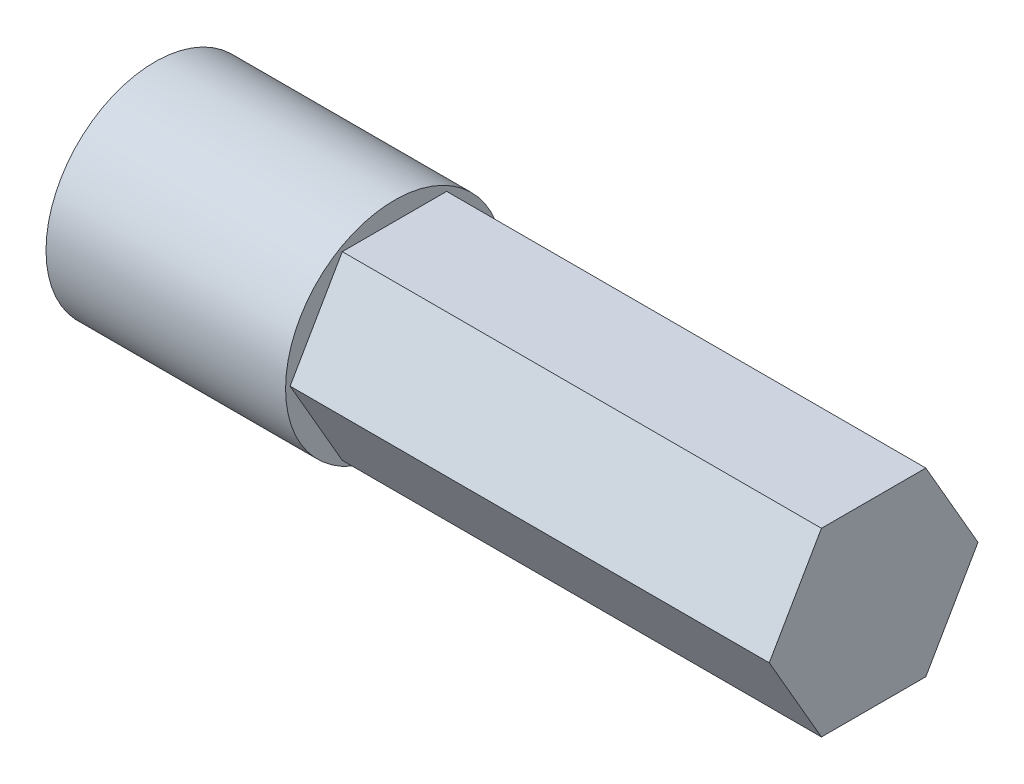
ISO-10303-21;
HEADER;
FILE_DESCRIPTION(('STEP AP214'),'2;1');
FILE_NAME('part.step','',(''),(''),'','','');
FILE_SCHEMA(('AUTOMOTIVE_DESIGN { 1 0 10303 214 1 1 1 1 }'));
ENDSEC;
DATA;
#1=APPLICATION_CONTEXT('core data for automotive mechanical design processes');
#2=APPLICATION_PROTOCOL_DEFINITION('international standard','automotive_design',2000,#1);
#3=PRODUCT_CONTEXT('',#1,'mechanical');
#4=PRODUCT('Part','Part','',(#3));
#5=PRODUCT_RELATED_PRODUCT_CATEGORY('part','',(#4));
#6=PRODUCT_DEFINITION_FORMATION('','',#4);
#7=PRODUCT_DEFINITION_CONTEXT('part definition',#1,'design');
#8=PRODUCT_DEFINITION('design','',#6,#7);
#9=PRODUCT_DEFINITION_SHAPE('','',#8);
#10=(LENGTH_UNIT() NAMED_UNIT(*) SI_UNIT(.MILLI.,.METRE.));
#11=(NAMED_UNIT(*) PLANE_ANGLE_UNIT() SI_UNIT($,.RADIAN.));
#12=(NAMED_UNIT(*) SI_UNIT($,.STERADIAN.) SOLID_ANGLE_UNIT());
#13=UNCERTAINTY_MEASURE_WITH_UNIT(LENGTH_MEASURE(1.E-05),#10,'distance_accuracy_value','');
#14=(GEOMETRIC_REPRESENTATION_CONTEXT(3) GLOBAL_UNCERTAINTY_ASSIGNED_CONTEXT((#13)) GLOBAL_UNIT_ASSIGNED_CONTEXT((#10,
#11,#12)) REPRESENTATION_CONTEXT('',''));
#15=CARTESIAN_POINT('',(0.,0.,0.));
#16=DIRECTION('',(0.,0.,1.));
#17=DIRECTION('',(1.,0.,0.));
#18=AXIS2_PLACEMENT_3D('',#15,#16,#17);
#19=CARTESIAN_POINT('',(22.,-4.15,2.39600361713695));
#20=DIRECTION('',(0.,1.,0.));
#21=DIRECTION('',(0.,0.,1.));
#22=AXIS2_PLACEMENT_3D('',#19,#20,#21);
#23=PLANE('',#22);
#24=DIRECTION('',(0.,0.,-1.));
#25=VECTOR('',#24,1.);
#26=CARTESIAN_POINT('',(0.,-4.15,2.39600361713695));
#27=LINE('',#26,#25);
#28=CARTESIAN_POINT('',(0.,-4.15,2.39600361713695));
#29=VERTEX_POINT('',#28);
#30=CARTESIAN_POINT('',(0.,-4.15,-2.39600361713695));
#31=VERTEX_POINT('',#30);
#32=EDGE_CURVE('E85',#29,#31,#27,.T.);
#33=ORIENTED_EDGE('',*,*,#32,.T.);
#34=DIRECTION('',(-1.,0.,0.));
#35=VECTOR('',#34,1.);
#36=CARTESIAN_POINT('',(22.,-4.15,-2.39600361713695));
#37=LINE('',#36,#35);
#38=CARTESIAN_POINT('',(22.,-4.15,-2.39600361713695));
#39=VERTEX_POINT('',#38);
#40=EDGE_CURVE('E11',#39,#31,#37,.T.);
#41=ORIENTED_EDGE('',*,*,#40,.F.);
#42=DIRECTION('',(0.,0.,-1.));
#43=VECTOR('',#42,1.);
#44=CARTESIAN_POINT('',(22.,-4.15,2.39600361713695));
#45=LINE('',#44,#43);
#46=CARTESIAN_POINT('',(22.,-4.15,2.39600361713695));
#47=VERTEX_POINT('',#46);
#48=EDGE_CURVE('E117',#47,#39,#45,.T.);
#49=ORIENTED_EDGE('',*,*,#48,.F.);
#50=DIRECTION('',(-1.,0.,0.));
#51=VECTOR('',#50,1.);
#52=CARTESIAN_POINT('',(22.,-4.15,2.39600361713695));
#53=LINE('',#52,#51);
#54=EDGE_CURVE('E99',#47,#29,#53,.T.);
#55=ORIENTED_EDGE('',*,*,#54,.T.);
#56=EDGE_LOOP('',(#33,#41,#49,#55));
#57=FACE_BOUND('',#56,.T.);
#58=ADVANCED_FACE('F33',(#57),#23,.F.);
#59=CARTESIAN_POINT('',(22.,-4.15,-2.39600361713695));
#60=DIRECTION('',(0.,0.5,0.866025403784439));
#61=DIRECTION('',(0.,-0.866025403784439,0.5));
#62=AXIS2_PLACEMENT_3D('',#59,#60,#61);
#63=PLANE('',#62);
#64=DIRECTION('',(0.,0.866025403784439,-0.5));
#65=VECTOR('',#64,1.);
#66=CARTESIAN_POINT('',(0.,-4.15,-2.39600361713695));
#67=LINE('',#66,#65);
#68=CARTESIAN_POINT('',(0.,0.,-4.79200723427389));
#69=VERTEX_POINT('',#68);
#70=EDGE_CURVE('E81',#31,#69,#67,.T.);
#71=ORIENTED_EDGE('',*,*,#70,.T.);
#72=DIRECTION('',(-1.,0.,0.));
#73=VECTOR('',#72,1.);
#74=CARTESIAN_POINT('',(22.,0.,-4.79200723427389));
#75=LINE('',#74,#73);
#76=CARTESIAN_POINT('',(22.,0.,-4.79200723427389));
#77=VERTEX_POINT('',#76);
#78=EDGE_CURVE('E41',#77,#69,#75,.T.);
#79=ORIENTED_EDGE('',*,*,#78,.F.);
#80=DIRECTION('',(0.,0.866025403784439,-0.5));
#81=VECTOR('',#80,1.);
#82=CARTESIAN_POINT('',(22.,-4.15,-2.39600361713695));
#83=LINE('',#82,#81);
#84=EDGE_CURVE('E95',#39,#77,#83,.T.);
#85=ORIENTED_EDGE('',*,*,#84,.F.);
#86=ORIENTED_EDGE('',*,*,#40,.T.);
#87=EDGE_LOOP('',(#71,#79,#85,#86));
#88=FACE_BOUND('',#87,.T.);
#89=ADVANCED_FACE('F94',(#88),#63,.F.);
#90=CARTESIAN_POINT('',(22.,0.,-4.79200723427389));
#91=DIRECTION('',(0.,-0.5,0.866025403784439));
#92=DIRECTION('',(0.,-0.866025403784439,-0.5));
#93=AXIS2_PLACEMENT_3D('',#90,#91,#92);
#94=PLANE('',#93);
#95=DIRECTION('',(0.,0.866025403784438,0.5));
#96=VECTOR('',#95,1.);
#97=CARTESIAN_POINT('',(0.,0.,-4.79200723427389));
#98=LINE('',#97,#96);
#99=CARTESIAN_POINT('',(0.,4.15,-2.39600361713694));
#100=VERTEX_POINT('',#99);
#101=EDGE_CURVE('E88',#69,#100,#98,.T.);
#102=ORIENTED_EDGE('',*,*,#101,.T.);
#103=DIRECTION('',(-1.,0.,0.));
#104=VECTOR('',#103,1.);
#105=CARTESIAN_POINT('',(22.,4.15,-2.39600361713694));
#106=LINE('',#105,#104);
#107=CARTESIAN_POINT('',(22.,4.15,-2.39600361713694));
#108=VERTEX_POINT('',#107);
#109=EDGE_CURVE('E125',#108,#100,#106,.T.);
#110=ORIENTED_EDGE('',*,*,#109,.F.);
#111=DIRECTION('',(0.,0.866025403784438,0.5));
#112=VECTOR('',#111,1.);
#113=CARTESIAN_POINT('',(22.,0.,-4.79200723427389));
#114=LINE('',#113,#112);
#115=EDGE_CURVE('E131',#77,#108,#114,.T.);
#116=ORIENTED_EDGE('',*,*,#115,.F.);
#117=ORIENTED_EDGE('',*,*,#78,.T.);
#118=EDGE_LOOP('',(#102,#110,#116,#117));
#119=FACE_BOUND('',#118,.T.);
#120=ADVANCED_FACE('F129',(#119),#94,.F.);
#121=CARTESIAN_POINT('',(22.,4.15,-2.39600361713694));
#122=DIRECTION('',(0.,-1.,0.));
#123=DIRECTION('',(0.,0.,-1.));
#124=AXIS2_PLACEMENT_3D('',#121,#122,#123);
#125=PLANE('',#124);
#126=DIRECTION('',(0.,0.,1.));
#127=VECTOR('',#126,1.);
#128=CARTESIAN_POINT('',(0.,4.15,-2.39600361713694));
#129=LINE('',#128,#127);
#130=CARTESIAN_POINT('',(0.,4.15,2.39600361713695));
#131=VERTEX_POINT('',#130);
#132=EDGE_CURVE('E109',#100,#131,#129,.T.);
#133=ORIENTED_EDGE('',*,*,#132,.T.);
#134=DIRECTION('',(-1.,0.,0.));
#135=VECTOR('',#134,1.);
#136=CARTESIAN_POINT('',(22.,4.15,2.39600361713695));
#137=LINE('',#136,#135);
#138=CARTESIAN_POINT('',(22.,4.15,2.39600361713695));
#139=VERTEX_POINT('',#138);
#140=EDGE_CURVE('E122',#139,#131,#137,.T.);
#141=ORIENTED_EDGE('',*,*,#140,.F.);
#142=DIRECTION('',(0.,0.,1.));
#143=VECTOR('',#142,1.);
#144=CARTESIAN_POINT('',(22.,4.15,-2.39600361713694));
#145=LINE('',#144,#143);
#146=EDGE_CURVE('E133',#108,#139,#145,.T.);
#147=ORIENTED_EDGE('',*,*,#146,.F.);
#148=ORIENTED_EDGE('',*,*,#109,.T.);
#149=EDGE_LOOP('',(#133,#141,#147,#148));
#150=FACE_BOUND('',#149,.T.);
#151=ADVANCED_FACE('F187',(#150),#125,.F.);
#152=CARTESIAN_POINT('',(22.,4.15,2.39600361713695));
#153=DIRECTION('',(0.,-0.5,-0.866025403784439));
#154=DIRECTION('',(0.,0.866025403784439,-0.5));
#155=AXIS2_PLACEMENT_3D('',#152,#153,#154);
#156=PLANE('',#155);
#157=DIRECTION('',(0.,-0.866025403784439,0.5));
#158=VECTOR('',#157,1.);
#159=CARTESIAN_POINT('',(0.,4.15,2.39600361713695));
#160=LINE('',#159,#158);
#161=CARTESIAN_POINT('',(0.,0.,4.79200723427389));
#162=VERTEX_POINT('',#161);
#163=EDGE_CURVE('E112',#131,#162,#160,.T.);
#164=ORIENTED_EDGE('',*,*,#163,.T.);
#165=DIRECTION('',(-1.,0.,0.));
#166=VECTOR('',#165,1.);
#167=CARTESIAN_POINT('',(22.,0.,4.79200723427389));
#168=LINE('',#167,#166);
#169=CARTESIAN_POINT('',(22.,0.,4.79200723427389));
#170=VERTEX_POINT('',#169);
#171=EDGE_CURVE('E119',#170,#162,#168,.T.);
#172=ORIENTED_EDGE('',*,*,#171,.F.);
#173=DIRECTION('',(0.,-0.866025403784439,0.5));
#174=VECTOR('',#173,1.);
#175=CARTESIAN_POINT('',(22.,4.15,2.39600361713695));
#176=LINE('',#175,#174);
#177=EDGE_CURVE('E135',#139,#170,#176,.T.);
#178=ORIENTED_EDGE('',*,*,#177,.F.);
#179=ORIENTED_EDGE('',*,*,#140,.T.);
#180=EDGE_LOOP('',(#164,#172,#178,#179));
#181=FACE_BOUND('',#180,.T.);
#182=ADVANCED_FACE('F144',(#181),#156,.F.);
#183=CARTESIAN_POINT('',(22.,0.,4.79200723427389));
#184=DIRECTION('',(0.,0.5,-0.866025403784439));
#185=DIRECTION('',(0.,0.866025403784439,0.5));
#186=AXIS2_PLACEMENT_3D('',#183,#184,#185);
#187=PLANE('',#186);
#188=DIRECTION('',(0.,-0.866025403784439,-0.5));
#189=VECTOR('',#188,1.);
#190=CARTESIAN_POINT('',(0.,0.,4.79200723427389));
#191=LINE('',#190,#189);
#192=EDGE_CURVE('E115',#162,#29,#191,.T.);
#193=ORIENTED_EDGE('',*,*,#192,.T.);
#194=ORIENTED_EDGE('',*,*,#54,.F.);
#195=DIRECTION('',(0.,-0.866025403784439,-0.5));
#196=VECTOR('',#195,1.);
#197=CARTESIAN_POINT('',(22.,0.,4.79200723427389));
#198=LINE('',#197,#196);
#199=EDGE_CURVE('E48',#170,#47,#198,.T.);
#200=ORIENTED_EDGE('',*,*,#199,.F.);
#201=ORIENTED_EDGE('',*,*,#171,.T.);
#202=EDGE_LOOP('',(#193,#194,#200,#201));
#203=FACE_BOUND('',#202,.T.);
#204=ADVANCED_FACE('F146',(#203),#187,.F.);
#205=CARTESIAN_POINT('',(22.,0.,0.));
#206=DIRECTION('',(1.,0.,0.));
#207=DIRECTION('',(0.,0.,-1.));
#208=AXIS2_PLACEMENT_3D('',#205,#206,#207);
#209=PLANE('',#208);
#210=ORIENTED_EDGE('',*,*,#48,.T.);
#211=ORIENTED_EDGE('',*,*,#84,.T.);
#212=ORIENTED_EDGE('',*,*,#115,.T.);
#213=ORIENTED_EDGE('',*,*,#146,.T.);
#214=ORIENTED_EDGE('',*,*,#177,.T.);
#215=ORIENTED_EDGE('',*,*,#199,.T.);
#216=EDGE_LOOP('',(#210,#211,#212,#213,#214,#215));
#217=FACE_BOUND('',#216,.T.);
#218=ADVANCED_FACE('F141',(#217),#209,.T.);
#219=CARTESIAN_POINT('',(-11.,0.,0.));
#220=DIRECTION('',(1.,0.,0.));
#221=DIRECTION('',(0.,0.,-1.));
#222=AXIS2_PLACEMENT_3D('',#219,#220,#221);
#223=CYLINDRICAL_SURFACE('',#222,5.);
#224=CARTESIAN_POINT('',(-11.,0.,0.));
#225=DIRECTION('',(-1.,0.,0.));
#226=DIRECTION('',(0.,0.,1.));
#227=AXIS2_PLACEMENT_3D('',#224,#225,#226);
#228=CIRCLE('',#227,5.);
#229=CARTESIAN_POINT('',(-11.,0.,5.));
#230=VERTEX_POINT('',#229);
#231=EDGE_CURVE('E100',#230,#230,#228,.T.);
#232=ORIENTED_EDGE('',*,*,#231,.F.);
#233=EDGE_LOOP('',(#232));
#234=FACE_BOUND('',#233,.T.);
#235=CARTESIAN_POINT('',(0.,0.,0.));
#236=DIRECTION('',(-1.,0.,0.));
#237=DIRECTION('',(0.,0.,1.));
#238=AXIS2_PLACEMENT_3D('',#235,#236,#237);
#239=CIRCLE('',#238,5.);
#240=CARTESIAN_POINT('',(0.,0.,5.));
#241=VERTEX_POINT('',#240);
#242=EDGE_CURVE('E103',#241,#241,#239,.T.);
#243=ORIENTED_EDGE('',*,*,#242,.T.);
#244=EDGE_LOOP('',(#243));
#245=FACE_BOUND('',#244,.T.);
#246=ADVANCED_FACE('F168',(#234,#245),#223,.T.);
#247=CARTESIAN_POINT('',(-11.,0.,0.));
#248=DIRECTION('',(-1.,0.,0.));
#249=DIRECTION('',(0.,0.,1.));
#250=AXIS2_PLACEMENT_3D('',#247,#248,#249);
#251=PLANE('',#250);
#252=CARTESIAN_POINT('',(-11.,0.,0.));
#253=DIRECTION('',(-1.,0.,0.));
#254=DIRECTION('',(0.,0.,1.));
#255=AXIS2_PLACEMENT_3D('',#252,#253,#254);
#256=CIRCLE('',#255,3.);
#257=CARTESIAN_POINT('',(-11.,0.,3.));
#258=VERTEX_POINT('',#257);
#259=EDGE_CURVE('E151',#258,#258,#256,.T.);
#260=ORIENTED_EDGE('',*,*,#259,.F.);
#261=EDGE_LOOP('',(#260));
#262=FACE_BOUND('',#261,.T.);
#263=ORIENTED_EDGE('',*,*,#231,.T.);
#264=EDGE_LOOP('',(#263));
#265=FACE_BOUND('',#264,.T.);
#266=ADVANCED_FACE('F165',(#262,#265),#251,.T.);
#267=CARTESIAN_POINT('',(0.,0.,0.));
#268=DIRECTION('',(-1.,0.,0.));
#269=DIRECTION('',(0.,0.,1.));
#270=AXIS2_PLACEMENT_3D('',#267,#268,#269);
#271=PLANE('',#270);
#272=ORIENTED_EDGE('',*,*,#32,.F.);
#273=ORIENTED_EDGE('',*,*,#192,.F.);
#274=ORIENTED_EDGE('',*,*,#163,.F.);
#275=ORIENTED_EDGE('',*,*,#132,.F.);
#276=ORIENTED_EDGE('',*,*,#101,.F.);
#277=ORIENTED_EDGE('',*,*,#70,.F.);
#278=EDGE_LOOP('',(#272,#273,#274,#275,#276,#277));
#279=FACE_BOUND('',#278,.T.);
#280=ORIENTED_EDGE('',*,*,#242,.F.);
#281=EDGE_LOOP('',(#280));
#282=FACE_BOUND('',#281,.T.);
#283=ADVANCED_FACE('F82',(#279,#282),#271,.F.);
#284=CARTESIAN_POINT('',(0.,0.,0.));
#285=DIRECTION('',(-1.,0.,0.));
#286=DIRECTION('',(0.,0.,1.));
#287=AXIS2_PLACEMENT_3D('',#284,#285,#286);
#288=CYLINDRICAL_SURFACE('',#287,3.);
#289=CARTESIAN_POINT('',(0.,0.,0.));
#290=DIRECTION('',(-1.,0.,0.));
#291=DIRECTION('',(0.,0.,1.));
#292=AXIS2_PLACEMENT_3D('',#289,#290,#291);
#293=CIRCLE('',#292,3.);
#294=CARTESIAN_POINT('',(0.,0.,3.));
#295=VERTEX_POINT('',#294);
#296=EDGE_CURVE('E149',#295,#295,#293,.T.);
#297=ORIENTED_EDGE('',*,*,#296,.F.);
#298=EDGE_LOOP('',(#297));
#299=FACE_BOUND('',#298,.T.);
#300=ORIENTED_EDGE('',*,*,#259,.T.);
#301=EDGE_LOOP('',(#300));
#302=FACE_BOUND('',#301,.T.);
#303=ADVANCED_FACE('F159',(#299,#302),#288,.F.);
#304=CARTESIAN_POINT('',(0.,0.,0.));
#305=DIRECTION('',(-1.,0.,0.));
#306=DIRECTION('',(0.,0.,1.));
#307=AXIS2_PLACEMENT_3D('',#304,#305,#306);
#308=PLANE('',#307);
#309=ORIENTED_EDGE('',*,*,#296,.T.);
#310=EDGE_LOOP('',(#309));
#311=FACE_BOUND('',#310,.T.);
#312=ADVANCED_FACE('F157',(#311),#308,.T.);
#313=CLOSED_SHELL('',(#58,#89,#120,#151,#182,#204,#218,#246,#266,#283,#303,#312));
#314=MANIFOLD_SOLID_BREP('B2',#313);
#315=ADVANCED_BREP_SHAPE_REPRESENTATION('',(#18,#314),#14);
#316=SHAPE_DEFINITION_REPRESENTATION(#9,#315);
ENDSEC;
END-ISO-10303-21;
